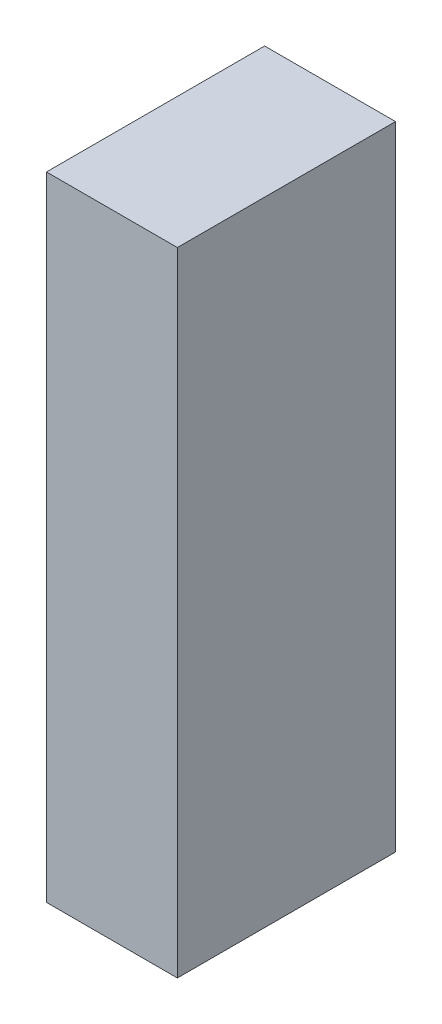
ISO-10303-21;
HEADER;
FILE_DESCRIPTION(('STEP AP214'),'2;1');
FILE_NAME('part.step','',(''),(''),'','','');
FILE_SCHEMA(('AUTOMOTIVE_DESIGN { 1 0 10303 214 1 1 1 1 }'));
ENDSEC;
DATA;
#1=APPLICATION_CONTEXT('core data for automotive mechanical design processes');
#2=APPLICATION_PROTOCOL_DEFINITION('international standard','automotive_design',2000,#1);
#3=PRODUCT_CONTEXT('',#1,'mechanical');
#4=PRODUCT('Part','Part','',(#3));
#5=PRODUCT_RELATED_PRODUCT_CATEGORY('part','',(#4));
#6=PRODUCT_DEFINITION_FORMATION('','',#4);
#7=PRODUCT_DEFINITION_CONTEXT('part definition',#1,'design');
#8=PRODUCT_DEFINITION('design','',#6,#7);
#9=PRODUCT_DEFINITION_SHAPE('','',#8);
#10=(LENGTH_UNIT() NAMED_UNIT(*) SI_UNIT(.MILLI.,.METRE.));
#11=(NAMED_UNIT(*) PLANE_ANGLE_UNIT() SI_UNIT($,.RADIAN.));
#12=(NAMED_UNIT(*) SI_UNIT($,.STERADIAN.) SOLID_ANGLE_UNIT());
#13=UNCERTAINTY_MEASURE_WITH_UNIT(LENGTH_MEASURE(1.E-05),#10,'distance_accuracy_value','');
#14=(GEOMETRIC_REPRESENTATION_CONTEXT(3) GLOBAL_UNCERTAINTY_ASSIGNED_CONTEXT((#13)) GLOBAL_UNIT_ASSIGNED_CONTEXT((#10,
#11,#12)) REPRESENTATION_CONTEXT('',''));
#15=CARTESIAN_POINT('',(0.,0.,0.));
#16=DIRECTION('',(0.,0.,1.));
#17=DIRECTION('',(1.,0.,0.));
#18=AXIS2_PLACEMENT_3D('',#15,#16,#17);
#19=CARTESIAN_POINT('',(-1.10001648278529,-0.725004635713134,-2.64111989736557));
#20=DIRECTION('',(-8.74227765734759E-08,-1.,0.));
#21=DIRECTION('',(1.,-8.74227765734759E-08,0.));
#22=AXIS2_PLACEMENT_3D('',#19,#20,#21);
#23=PLANE('',#22);
#24=DIRECTION('',(0.999999999999996,-8.74227766645429E-08,0.));
#25=VECTOR('',#24,1.);
#26=CARTESIAN_POINT('',(-1.10001648278529,-0.725004635713134,-2.64111989736557));
#27=LINE('',#26,#25);
#28=CARTESIAN_POINT('',(-1.10001648278529,-0.725004635713134,-2.64111989736557));
#29=VERTEX_POINT('',#28);
#30=CARTESIAN_POINT('',(-0.799998172238418,-0.725004661941568,-2.64111989736557));
#31=VERTEX_POINT('',#30);
#32=EDGE_CURVE('E11',#29,#31,#27,.T.);
#33=ORIENTED_EDGE('',*,*,#32,.T.);
#34=DIRECTION('',(0.,0.,1.));
#35=VECTOR('',#34,1.);
#36=CARTESIAN_POINT('',(-0.799998172238418,-0.725004661941568,-2.64111989736557));
#37=LINE('',#36,#35);
#38=CARTESIAN_POINT('',(-0.799998172238418,-0.725004661941568,-2.14112091064453));
#39=VERTEX_POINT('',#38);
#40=EDGE_CURVE('E88',#31,#39,#37,.T.);
#41=ORIENTED_EDGE('',*,*,#40,.T.);
#42=DIRECTION('',(0.999999999999996,-8.74227766645429E-08,0.));
#43=VECTOR('',#42,1.);
#44=CARTESIAN_POINT('',(-1.10001648278529,-0.725004635713134,-2.14112091064453));
#45=LINE('',#44,#43);
#46=CARTESIAN_POINT('',(-1.10001648278529,-0.725004635713134,-2.14112091064453));
#47=VERTEX_POINT('',#46);
#48=EDGE_CURVE('E83',#47,#39,#45,.T.);
#49=ORIENTED_EDGE('',*,*,#48,.F.);
#50=DIRECTION('',(0.,0.,1.));
#51=VECTOR('',#50,1.);
#52=CARTESIAN_POINT('',(-1.10001648278528,-0.725004635713134,-2.64111989736557));
#53=LINE('',#52,#51);
#54=EDGE_CURVE('E72',#29,#47,#53,.T.);
#55=ORIENTED_EDGE('',*,*,#54,.F.);
#56=EDGE_LOOP('',(#33,#41,#49,#55));
#57=FACE_BOUND('',#56,.T.);
#58=ADVANCED_FACE('F17',(#57),#23,.T.);
#59=CARTESIAN_POINT('',(-0.799998172238418,-0.725004661941568,-2.64111989736557));
#60=DIRECTION('',(1.,-8.74227765734759E-08,0.));
#61=DIRECTION('',(8.74227765734759E-08,1.,0.));
#62=AXIS2_PLACEMENT_3D('',#59,#60,#61);
#63=PLANE('',#62);
#64=DIRECTION('',(8.74227765590445E-08,0.999999999999996,0.));
#65=VECTOR('',#64,1.);
#66=CARTESIAN_POINT('',(-0.799998172238418,-0.725004661941568,-2.64111989736557));
#67=LINE('',#66,#65);
#68=CARTESIAN_POINT('',(-0.799998045474979,0.72499991569515,-2.64111989736557));
#69=VERTEX_POINT('',#68);
#70=EDGE_CURVE('E24',#31,#69,#67,.T.);
#71=ORIENTED_EDGE('',*,*,#70,.T.);
#72=DIRECTION('',(0.,0.,1.));
#73=VECTOR('',#72,1.);
#74=CARTESIAN_POINT('',(-0.799998045474992,0.72499991569515,-2.64111989736557));
#75=LINE('',#74,#73);
#76=CARTESIAN_POINT('',(-0.799998045474979,0.72499991569515,-2.14112091064453));
#77=VERTEX_POINT('',#76);
#78=EDGE_CURVE('E85',#69,#77,#75,.T.);
#79=ORIENTED_EDGE('',*,*,#78,.T.);
#80=DIRECTION('',(8.74227765590445E-08,0.999999999999996,0.));
#81=VECTOR('',#80,1.);
#82=CARTESIAN_POINT('',(-0.799998172238418,-0.725004661941568,-2.14112091064453));
#83=LINE('',#82,#81);
#84=EDGE_CURVE('E66',#39,#77,#83,.T.);
#85=ORIENTED_EDGE('',*,*,#84,.F.);
#86=ORIENTED_EDGE('',*,*,#40,.F.);
#87=EDGE_LOOP('',(#71,#79,#85,#86));
#88=FACE_BOUND('',#87,.T.);
#89=ADVANCED_FACE('F89',(#88),#63,.T.);
#90=CARTESIAN_POINT('',(-0.799998045474979,0.72499991569515,-2.64111989736557));
#91=DIRECTION('',(8.74227765734759E-08,1.,0.));
#92=DIRECTION('',(-1.,8.74227765734759E-08,0.));
#93=AXIS2_PLACEMENT_3D('',#90,#91,#92);
#94=PLANE('',#93);
#95=DIRECTION('',(-0.999999999999996,8.74227766645429E-08,0.));
#96=VECTOR('',#95,1.);
#97=CARTESIAN_POINT('',(-0.799998045474979,0.72499991569515,-2.64111989736557));
#98=LINE('',#97,#96);
#99=CARTESIAN_POINT('',(-1.10001635602185,0.724999941923585,-2.64111989736557));
#100=VERTEX_POINT('',#99);
#101=EDGE_CURVE('E62',#69,#100,#98,.T.);
#102=ORIENTED_EDGE('',*,*,#101,.T.);
#103=DIRECTION('',(0.,0.,1.));
#104=VECTOR('',#103,1.);
#105=CARTESIAN_POINT('',(-1.10001635602185,0.724999941923584,-2.64111989736557));
#106=LINE('',#105,#104);
#107=CARTESIAN_POINT('',(-1.10001635602185,0.724999941923585,-2.14112091064453));
#108=VERTEX_POINT('',#107);
#109=EDGE_CURVE('E55',#100,#108,#106,.T.);
#110=ORIENTED_EDGE('',*,*,#109,.T.);
#111=DIRECTION('',(-0.999999999999996,8.74227766645429E-08,0.));
#112=VECTOR('',#111,1.);
#113=CARTESIAN_POINT('',(-0.799998045474979,0.72499991569515,-2.14112091064453));
#114=LINE('',#113,#112);
#115=EDGE_CURVE('E59',#77,#108,#114,.T.);
#116=ORIENTED_EDGE('',*,*,#115,.F.);
#117=ORIENTED_EDGE('',*,*,#78,.F.);
#118=EDGE_LOOP('',(#102,#110,#116,#117));
#119=FACE_BOUND('',#118,.T.);
#120=ADVANCED_FACE('F57',(#119),#94,.T.);
#121=CARTESIAN_POINT('',(-1.10001635602185,0.724999941923585,-2.64111989736557));
#122=DIRECTION('',(-1.,8.74227765734759E-08,0.));
#123=DIRECTION('',(-8.74227765734759E-08,-1.,0.));
#124=AXIS2_PLACEMENT_3D('',#121,#122,#123);
#125=PLANE('',#124);
#126=DIRECTION('',(-8.74227765590445E-08,-0.999999999999996,0.));
#127=VECTOR('',#126,1.);
#128=CARTESIAN_POINT('',(-1.10001635602185,0.724999941923585,-2.64111989736557));
#129=LINE('',#128,#127);
#130=EDGE_CURVE('E65',#100,#29,#129,.T.);
#131=ORIENTED_EDGE('',*,*,#130,.T.);
#132=ORIENTED_EDGE('',*,*,#54,.T.);
#133=DIRECTION('',(-8.74227765590445E-08,-0.999999999999996,0.));
#134=VECTOR('',#133,1.);
#135=CARTESIAN_POINT('',(-1.10001635602185,0.724999941923585,-2.14112091064453));
#136=LINE('',#135,#134);
#137=EDGE_CURVE('E70',#108,#47,#136,.T.);
#138=ORIENTED_EDGE('',*,*,#137,.F.);
#139=ORIENTED_EDGE('',*,*,#109,.F.);
#140=EDGE_LOOP('',(#131,#132,#138,#139));
#141=FACE_BOUND('',#140,.T.);
#142=ADVANCED_FACE('F71',(#141),#125,.T.);
#143=CARTESIAN_POINT('',(277.5,117.999977111816,-2.14112091064453));
#144=DIRECTION('',(0.,0.,1.));
#145=DIRECTION('',(-1.,8.74227765734759E-08,0.));
#146=AXIS2_PLACEMENT_3D('',#143,#144,#145);
#147=PLANE('',#146);
#148=ORIENTED_EDGE('',*,*,#48,.T.);
#149=ORIENTED_EDGE('',*,*,#84,.T.);
#150=ORIENTED_EDGE('',*,*,#115,.T.);
#151=ORIENTED_EDGE('',*,*,#137,.T.);
#152=EDGE_LOOP('',(#148,#149,#150,#151));
#153=FACE_BOUND('',#152,.T.);
#154=ADVANCED_FACE('F76',(#153),#147,.T.);
#155=CARTESIAN_POINT('',(277.5,117.999977111816,-2.64111989736557));
#156=DIRECTION('',(0.,0.,1.));
#157=DIRECTION('',(-1.,8.74227765734759E-08,0.));
#158=AXIS2_PLACEMENT_3D('',#155,#156,#157);
#159=PLANE('',#158);
#160=ORIENTED_EDGE('',*,*,#130,.F.);
#161=ORIENTED_EDGE('',*,*,#101,.F.);
#162=ORIENTED_EDGE('',*,*,#70,.F.);
#163=ORIENTED_EDGE('',*,*,#32,.F.);
#164=EDGE_LOOP('',(#160,#161,#162,#163));
#165=FACE_BOUND('',#164,.T.);
#166=ADVANCED_FACE('F91',(#165),#159,.F.);
#167=CLOSED_SHELL('',(#58,#89,#120,#142,#154,#166));
#168=MANIFOLD_SOLID_BREP('B1',#167);
#169=ADVANCED_BREP_SHAPE_REPRESENTATION('',(#18,#168),#14);
#170=SHAPE_DEFINITION_REPRESENTATION(#9,#169);
ENDSEC;
END-ISO-10303-21;
